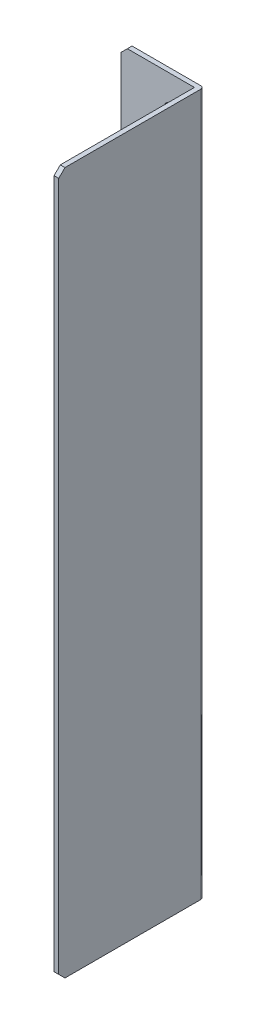
ISO-10303-21;
HEADER;
FILE_DESCRIPTION(('STEP AP214'),'2;1');
FILE_NAME('part.step','',(''),(''),'','','');
FILE_SCHEMA(('AUTOMOTIVE_DESIGN { 1 0 10303 214 1 1 1 1 }'));
ENDSEC;
DATA;
#1=APPLICATION_CONTEXT('core data for automotive mechanical design processes');
#2=APPLICATION_PROTOCOL_DEFINITION('international standard','automotive_design',2000,#1);
#3=PRODUCT_CONTEXT('',#1,'mechanical');
#4=PRODUCT('Part','Part','',(#3));
#5=PRODUCT_RELATED_PRODUCT_CATEGORY('part','',(#4));
#6=PRODUCT_DEFINITION_FORMATION('','',#4);
#7=PRODUCT_DEFINITION_CONTEXT('part definition',#1,'design');
#8=PRODUCT_DEFINITION('design','',#6,#7);
#9=PRODUCT_DEFINITION_SHAPE('','',#8);
#10=(LENGTH_UNIT() NAMED_UNIT(*) SI_UNIT(.MILLI.,.METRE.));
#11=(NAMED_UNIT(*) PLANE_ANGLE_UNIT() SI_UNIT($,.RADIAN.));
#12=(NAMED_UNIT(*) SI_UNIT($,.STERADIAN.) SOLID_ANGLE_UNIT());
#13=UNCERTAINTY_MEASURE_WITH_UNIT(LENGTH_MEASURE(1.E-05),#10,'distance_accuracy_value','');
#14=(GEOMETRIC_REPRESENTATION_CONTEXT(3) GLOBAL_UNCERTAINTY_ASSIGNED_CONTEXT((#13)) GLOBAL_UNIT_ASSIGNED_CONTEXT((#10,
#11,#12)) REPRESENTATION_CONTEXT('',''));
#15=CARTESIAN_POINT('',(0.,0.,0.));
#16=DIRECTION('',(0.,0.,1.));
#17=DIRECTION('',(1.,0.,0.));
#18=AXIS2_PLACEMENT_3D('',#15,#16,#17);
#19=CARTESIAN_POINT('',(-12.9672897196262,188.376168224299,1.5));
#20=DIRECTION('',(1.,0.,0.));
#21=DIRECTION('',(0.,1.,0.));
#22=AXIS2_PLACEMENT_3D('',#19,#20,#21);
#23=PLANE('',#22);
#24=DIRECTION('',(0.,-1.,0.));
#25=VECTOR('',#24,1.);
#26=CARTESIAN_POINT('',(-12.9672897196262,188.376168224299,1.5));
#27=LINE('',#26,#25);
#28=CARTESIAN_POINT('',(-12.9672897196262,186.376168224299,1.5));
#29=VERTEX_POINT('',#28);
#30=CARTESIAN_POINT('',(-12.9672897196262,-26.6238317757009,1.5));
#31=VERTEX_POINT('',#30);
#32=EDGE_CURVE('E161',#29,#31,#27,.T.);
#33=ORIENTED_EDGE('',*,*,#32,.F.);
#34=DIRECTION('',(0.,0.,-1.));
#35=VECTOR('',#34,1.);
#36=CARTESIAN_POINT('',(-12.9672897196262,186.376168224299,1.5));
#37=LINE('',#36,#35);
#38=CARTESIAN_POINT('',(-12.9672897196262,186.376168224299,0.));
#39=VERTEX_POINT('',#38);
#40=EDGE_CURVE('E189',#29,#39,#37,.T.);
#41=ORIENTED_EDGE('',*,*,#40,.T.);
#42=DIRECTION('',(0.,-1.,0.));
#43=VECTOR('',#42,1.);
#44=CARTESIAN_POINT('',(-12.9672897196262,188.376168224299,0.));
#45=LINE('',#44,#43);
#46=CARTESIAN_POINT('',(-12.9672897196262,-26.6238317757009,0.));
#47=VERTEX_POINT('',#46);
#48=EDGE_CURVE('E160',#39,#47,#45,.T.);
#49=ORIENTED_EDGE('',*,*,#48,.T.);
#50=DIRECTION('',(0.,0.,-1.));
#51=VECTOR('',#50,1.);
#52=CARTESIAN_POINT('',(-12.9672897196262,-26.6238317757009,1.5));
#53=LINE('',#52,#51);
#54=EDGE_CURVE('E186',#31,#47,#53,.T.);
#55=ORIENTED_EDGE('',*,*,#54,.F.);
#56=EDGE_LOOP('',(#33,#41,#49,#55));
#57=FACE_BOUND('',#56,.T.);
#58=ADVANCED_FACE('F33',(#57),#23,.F.);
#59=CARTESIAN_POINT('',(-12.9672897196262,-26.6238317757009,1.5));
#60=DIRECTION('',(0.,1.,0.));
#61=DIRECTION('',(0.,0.,1.));
#62=AXIS2_PLACEMENT_3D('',#59,#60,#61);
#63=PLANE('',#62);
#64=DIRECTION('',(1.,0.,0.));
#65=VECTOR('',#64,1.);
#66=CARTESIAN_POINT('',(-12.9672897196262,-26.6238317757009,0.));
#67=LINE('',#66,#65);
#68=CARTESIAN_POINT('',(-7.96728971962616,-26.6238317757009,0.));
#69=VERTEX_POINT('',#68);
#70=EDGE_CURVE('E170',#47,#69,#67,.T.);
#71=ORIENTED_EDGE('',*,*,#70,.T.);
#72=DIRECTION('',(0.,0.,-1.));
#73=VECTOR('',#72,1.);
#74=CARTESIAN_POINT('',(-7.96728971962616,-26.6238317757009,1.5));
#75=LINE('',#74,#73);
#76=CARTESIAN_POINT('',(-7.96728971962616,-26.6238317757009,1.5));
#77=VERTEX_POINT('',#76);
#78=EDGE_CURVE('E183',#77,#69,#75,.T.);
#79=ORIENTED_EDGE('',*,*,#78,.F.);
#80=DIRECTION('',(1.,0.,0.));
#81=VECTOR('',#80,1.);
#82=CARTESIAN_POINT('',(-12.9672897196262,-26.6238317757009,1.5));
#83=LINE('',#82,#81);
#84=EDGE_CURVE('E163',#31,#77,#83,.T.);
#85=ORIENTED_EDGE('',*,*,#84,.F.);
#86=ORIENTED_EDGE('',*,*,#54,.T.);
#87=EDGE_LOOP('',(#71,#79,#85,#86));
#88=FACE_BOUND('',#87,.T.);
#89=ADVANCED_FACE('F248',(#88),#63,.F.);
#90=CARTESIAN_POINT('',(-7.96728971962616,-36.6238317757009,1.5));
#91=DIRECTION('',(1.,0.,0.));
#92=DIRECTION('',(0.,0.,-1.));
#93=AXIS2_PLACEMENT_3D('',#90,#91,#92);
#94=PLANE('',#93);
#95=DIRECTION('',(0.,-1.,0.));
#96=VECTOR('',#95,1.);
#97=CARTESIAN_POINT('',(-7.96728971962616,-36.6238317757009,0.));
#98=LINE('',#97,#96);
#99=CARTESIAN_POINT('',(-7.96728971962616,-36.6238317757009,0.));
#100=VERTEX_POINT('',#99);
#101=EDGE_CURVE('E172',#69,#100,#98,.T.);
#102=ORIENTED_EDGE('',*,*,#101,.T.);
#103=DIRECTION('',(0.,0.,-1.));
#104=VECTOR('',#103,1.);
#105=CARTESIAN_POINT('',(-7.96728971962616,-36.6238317757009,1.5));
#106=LINE('',#105,#104);
#107=CARTESIAN_POINT('',(-7.96728971962616,-36.6238317757009,1.5));
#108=VERTEX_POINT('',#107);
#109=EDGE_CURVE('E181',#108,#100,#106,.T.);
#110=ORIENTED_EDGE('',*,*,#109,.F.);
#111=DIRECTION('',(0.,-1.,0.));
#112=VECTOR('',#111,1.);
#113=CARTESIAN_POINT('',(-7.96728971962616,-36.6238317757009,1.5));
#114=LINE('',#113,#112);
#115=EDGE_CURVE('E142',#77,#108,#114,.T.);
#116=ORIENTED_EDGE('',*,*,#115,.F.);
#117=ORIENTED_EDGE('',*,*,#78,.T.);
#118=EDGE_LOOP('',(#102,#110,#116,#117));
#119=FACE_BOUND('',#118,.T.);
#120=ADVANCED_FACE('F254',(#119),#94,.F.);
#121=CARTESIAN_POINT('',(-7.96728971962616,-36.6238317757009,1.5));
#122=DIRECTION('',(0.,1.,0.));
#123=DIRECTION('',(0.,0.,1.));
#124=AXIS2_PLACEMENT_3D('',#121,#122,#123);
#125=PLANE('',#124);
#126=DIRECTION('',(1.,0.,0.));
#127=VECTOR('',#126,1.);
#128=CARTESIAN_POINT('',(-7.96728971962616,-36.6238317757009,0.));
#129=LINE('',#128,#127);
#130=CARTESIAN_POINT('',(11.0327102803738,-36.6238317757009,0.));
#131=VERTEX_POINT('',#130);
#132=EDGE_CURVE('E174',#100,#131,#129,.T.);
#133=ORIENTED_EDGE('',*,*,#132,.T.);
#134=CARTESIAN_POINT('',(11.0327102803738,-36.6238317757009,1.));
#135=DIRECTION('',(0.,1.,0.));
#136=DIRECTION('',(0.,0.,1.));
#137=AXIS2_PLACEMENT_3D('',#134,#135,#136);
#138=CIRCLE('',#137,1.);
#139=CARTESIAN_POINT('',(12.0327102803738,-36.6238317757009,1.));
#140=VERTEX_POINT('',#139);
#141=EDGE_CURVE('E11',#131,#140,#138,.F.);
#142=ORIENTED_EDGE('',*,*,#141,.T.);
#143=DIRECTION('',(0.,0.,-1.));
#144=VECTOR('',#143,1.);
#145=CARTESIAN_POINT('',(12.0327102803738,-36.6238317757009,1.5));
#146=LINE('',#145,#144);
#147=CARTESIAN_POINT('',(12.0327102803738,-36.6238317757009,44.4999999999999));
#148=VERTEX_POINT('',#147);
#149=EDGE_CURVE('E178',#148,#140,#146,.T.);
#150=ORIENTED_EDGE('',*,*,#149,.F.);
#151=DIRECTION('',(-1.,0.,0.));
#152=VECTOR('',#151,1.);
#153=CARTESIAN_POINT('',(10.5327102803738,-36.6238317757009,44.4999999999999));
#154=LINE('',#153,#152);
#155=CARTESIAN_POINT('',(10.5327102803738,-36.6238317757009,44.4999999999999));
#156=VERTEX_POINT('',#155);
#157=EDGE_CURVE('E128',#148,#156,#154,.T.);
#158=ORIENTED_EDGE('',*,*,#157,.T.);
#159=DIRECTION('',(0.,0.,-1.));
#160=VECTOR('',#159,1.);
#161=CARTESIAN_POINT('',(10.5327102803738,-36.6238317757009,46.5));
#162=LINE('',#161,#160);
#163=CARTESIAN_POINT('',(10.5327102803738,-36.6238317757009,1.5));
#164=VERTEX_POINT('',#163);
#165=EDGE_CURVE('E121',#156,#164,#162,.T.);
#166=ORIENTED_EDGE('',*,*,#165,.T.);
#167=DIRECTION('',(1.,0.,0.));
#168=VECTOR('',#167,1.);
#169=CARTESIAN_POINT('',(-7.96728971962616,-36.6238317757009,1.5));
#170=LINE('',#169,#168);
#171=EDGE_CURVE('E125',#108,#164,#170,.T.);
#172=ORIENTED_EDGE('',*,*,#171,.F.);
#173=ORIENTED_EDGE('',*,*,#109,.T.);
#174=EDGE_LOOP('',(#133,#142,#150,#158,#166,#172,#173));
#175=FACE_BOUND('',#174,.T.);
#176=ADVANCED_FACE('F123',(#175),#125,.F.);
#177=CARTESIAN_POINT('',(12.0327102803738,188.376168224299,1.5));
#178=DIRECTION('',(-1.,0.,0.));
#179=DIRECTION('',(0.,-1.,0.));
#180=AXIS2_PLACEMENT_3D('',#177,#178,#179);
#181=PLANE('',#180);
#182=ORIENTED_EDGE('',*,*,#149,.T.);
#183=DIRECTION('',(0.,1.,0.));
#184=VECTOR('',#183,1.);
#185=CARTESIAN_POINT('',(12.0327102803738,188.376168224299,1.));
#186=LINE('',#185,#184);
#187=CARTESIAN_POINT('',(12.0327102803738,188.376168224299,1.));
#188=VERTEX_POINT('',#187);
#189=EDGE_CURVE('E216',#140,#188,#186,.T.);
#190=ORIENTED_EDGE('',*,*,#189,.T.);
#191=DIRECTION('',(0.,0.,-1.));
#192=VECTOR('',#191,1.);
#193=CARTESIAN_POINT('',(12.0327102803738,188.376168224299,1.5));
#194=LINE('',#193,#192);
#195=CARTESIAN_POINT('',(12.0327102803738,188.376168224299,44.5));
#196=VERTEX_POINT('',#195);
#197=EDGE_CURVE('E168',#196,#188,#194,.T.);
#198=ORIENTED_EDGE('',*,*,#197,.F.);
#199=DIRECTION('',(0.,-0.707106781186552,0.707106781186543));
#200=VECTOR('',#199,1.);
#201=CARTESIAN_POINT('',(12.0327102803738,186.376168224299,46.5));
#202=LINE('',#201,#200);
#203=CARTESIAN_POINT('',(12.0327102803738,186.376168224299,46.5));
#204=VERTEX_POINT('',#203);
#205=EDGE_CURVE('E213',#196,#204,#202,.T.);
#206=ORIENTED_EDGE('',*,*,#205,.T.);
#207=DIRECTION('',(0.,1.,0.));
#208=VECTOR('',#207,1.);
#209=CARTESIAN_POINT('',(12.0327102803738,-36.6238317757009,46.5));
#210=LINE('',#209,#208);
#211=CARTESIAN_POINT('',(12.0327102803738,-34.6238317757009,46.5));
#212=VERTEX_POINT('',#211);
#213=EDGE_CURVE('E149',#212,#204,#210,.T.);
#214=ORIENTED_EDGE('',*,*,#213,.F.);
#215=DIRECTION('',(0.,-0.707106781186548,-0.707106781186548));
#216=VECTOR('',#215,1.);
#217=CARTESIAN_POINT('',(12.0327102803738,-34.6238317757009,46.5));
#218=LINE('',#217,#216);
#219=EDGE_CURVE('E211',#212,#148,#218,.T.);
#220=ORIENTED_EDGE('',*,*,#219,.T.);
#221=EDGE_LOOP('',(#182,#190,#198,#206,#214,#220));
#222=FACE_BOUND('',#221,.T.);
#223=ADVANCED_FACE('F222',(#222),#181,.F.);
#224=CARTESIAN_POINT('',(-12.9672897196262,188.376168224299,1.5));
#225=DIRECTION('',(0.,-1.,0.));
#226=DIRECTION('',(0.,0.,-1.));
#227=AXIS2_PLACEMENT_3D('',#224,#225,#226);
#228=PLANE('',#227);
#229=ORIENTED_EDGE('',*,*,#197,.T.);
#230=CARTESIAN_POINT('',(11.0327102803738,188.376168224299,1.));
#231=DIRECTION('',(0.,-1.,0.));
#232=DIRECTION('',(0.,0.,-1.));
#233=AXIS2_PLACEMENT_3D('',#230,#231,#232);
#234=CIRCLE('',#233,1.);
#235=CARTESIAN_POINT('',(11.0327102803738,188.376168224299,0.));
#236=VERTEX_POINT('',#235);
#237=EDGE_CURVE('E55',#188,#236,#234,.F.);
#238=ORIENTED_EDGE('',*,*,#237,.T.);
#239=DIRECTION('',(-1.,0.,0.));
#240=VECTOR('',#239,1.);
#241=CARTESIAN_POINT('',(-12.9672897196262,188.376168224299,0.));
#242=LINE('',#241,#240);
#243=CARTESIAN_POINT('',(-10.9672897196262,188.376168224299,0.));
#244=VERTEX_POINT('',#243);
#245=EDGE_CURVE('E164',#236,#244,#242,.T.);
#246=ORIENTED_EDGE('',*,*,#245,.T.);
#247=DIRECTION('',(0.,0.,1.));
#248=VECTOR('',#247,1.);
#249=CARTESIAN_POINT('',(-10.9672897196262,188.376168224299,1.5));
#250=LINE('',#249,#248);
#251=CARTESIAN_POINT('',(-10.9672897196262,188.376168224299,1.5));
#252=VERTEX_POINT('',#251);
#253=EDGE_CURVE('E197',#244,#252,#250,.T.);
#254=ORIENTED_EDGE('',*,*,#253,.T.);
#255=DIRECTION('',(-1.,0.,0.));
#256=VECTOR('',#255,1.);
#257=CARTESIAN_POINT('',(-12.9672897196262,188.376168224299,1.5));
#258=LINE('',#257,#256);
#259=CARTESIAN_POINT('',(10.5327102803738,188.376168224299,1.5));
#260=VERTEX_POINT('',#259);
#261=EDGE_CURVE('E144',#260,#252,#258,.T.);
#262=ORIENTED_EDGE('',*,*,#261,.F.);
#263=DIRECTION('',(0.,0.,-1.));
#264=VECTOR('',#263,1.);
#265=CARTESIAN_POINT('',(10.5327102803738,188.376168224299,46.5));
#266=LINE('',#265,#264);
#267=CARTESIAN_POINT('',(10.5327102803738,188.376168224299,44.5));
#268=VERTEX_POINT('',#267);
#269=EDGE_CURVE('E132',#268,#260,#266,.T.);
#270=ORIENTED_EDGE('',*,*,#269,.F.);
#271=DIRECTION('',(1.,0.,0.));
#272=VECTOR('',#271,1.);
#273=CARTESIAN_POINT('',(12.0327102803738,188.376168224299,44.5));
#274=LINE('',#273,#272);
#275=EDGE_CURVE('E195',#268,#196,#274,.T.);
#276=ORIENTED_EDGE('',*,*,#275,.T.);
#277=EDGE_LOOP('',(#229,#238,#246,#254,#262,#270,#276));
#278=FACE_BOUND('',#277,.T.);
#279=ADVANCED_FACE('F226',(#278),#228,.F.);
#280=CARTESIAN_POINT('',(0.,0.,1.5));
#281=DIRECTION('',(0.,0.,1.));
#282=DIRECTION('',(1.,0.,0.));
#283=AXIS2_PLACEMENT_3D('',#280,#281,#282);
#284=PLANE('',#283);
#285=CARTESIAN_POINT('',(3.03271028037384,-29.0146314642925,1.5));
#286=DIRECTION('',(0.,0.,1.));
#287=DIRECTION('',(1.,0.,0.));
#288=AXIS2_PLACEMENT_3D('',#285,#286,#287);
#289=CIRCLE('',#288,2.25);
#290=CARTESIAN_POINT('',(5.28271028037384,-29.0146314642925,1.5));
#291=VERTEX_POINT('',#290);
#292=EDGE_CURVE('E403',#291,#291,#289,.T.);
#293=ORIENTED_EDGE('',*,*,#292,.F.);
#294=EDGE_LOOP('',(#293));
#295=FACE_BOUND('',#294,.T.);
#296=CARTESIAN_POINT('',(3.03271028037384,177.946548893374,1.5));
#297=DIRECTION('',(0.,0.,1.));
#298=DIRECTION('',(1.,0.,0.));
#299=AXIS2_PLACEMENT_3D('',#296,#297,#298);
#300=CIRCLE('',#299,2.25);
#301=CARTESIAN_POINT('',(5.28271028037384,177.946548893374,1.5));
#302=VERTEX_POINT('',#301);
#303=EDGE_CURVE('E155',#302,#302,#300,.T.);
#304=ORIENTED_EDGE('',*,*,#303,.F.);
#305=EDGE_LOOP('',(#304));
#306=FACE_BOUND('',#305,.T.);
#307=ORIENTED_EDGE('',*,*,#261,.T.);
#308=DIRECTION('',(0.707106781186543,0.707106781186552,0.));
#309=VECTOR('',#308,1.);
#310=CARTESIAN_POINT('',(-99.6717289719627,99.6717289719613,1.5));
#311=LINE('',#310,#309);
#312=EDGE_CURVE('E199',#252,#29,#311,.F.);
#313=ORIENTED_EDGE('',*,*,#312,.T.);
#314=ORIENTED_EDGE('',*,*,#32,.T.);
#315=ORIENTED_EDGE('',*,*,#84,.T.);
#316=ORIENTED_EDGE('',*,*,#115,.T.);
#317=ORIENTED_EDGE('',*,*,#171,.T.);
#318=DIRECTION('',(0.,-1.,0.));
#319=VECTOR('',#318,1.);
#320=CARTESIAN_POINT('',(10.5327102803738,-36.6238317757009,1.5));
#321=LINE('',#320,#319);
#322=EDGE_CURVE('E139',#260,#164,#321,.T.);
#323=ORIENTED_EDGE('',*,*,#322,.F.);
#324=EDGE_LOOP('',(#307,#313,#314,#315,#316,#317,#323));
#325=FACE_BOUND('',#324,.T.);
#326=ADVANCED_FACE('F138',(#295,#306,#325),#284,.T.);
#327=CARTESIAN_POINT('',(0.,0.,0.));
#328=DIRECTION('',(0.,0.,1.));
#329=DIRECTION('',(1.,0.,0.));
#330=AXIS2_PLACEMENT_3D('',#327,#328,#329);
#331=PLANE('',#330);
#332=CARTESIAN_POINT('',(3.03271028037384,-29.0146314642925,0.));
#333=DIRECTION('',(0.,0.,1.));
#334=DIRECTION('',(1.,0.,0.));
#335=AXIS2_PLACEMENT_3D('',#332,#333,#334);
#336=CIRCLE('',#335,2.25);
#337=CARTESIAN_POINT('',(5.28271028037384,-29.0146314642925,0.));
#338=VERTEX_POINT('',#337);
#339=EDGE_CURVE('E400',#338,#338,#336,.T.);
#340=ORIENTED_EDGE('',*,*,#339,.T.);
#341=EDGE_LOOP('',(#340));
#342=FACE_BOUND('',#341,.T.);
#343=CARTESIAN_POINT('',(3.03271028037384,177.946548893374,0.));
#344=DIRECTION('',(0.,0.,1.));
#345=DIRECTION('',(1.,0.,0.));
#346=AXIS2_PLACEMENT_3D('',#343,#344,#345);
#347=CIRCLE('',#346,2.25);
#348=CARTESIAN_POINT('',(5.28271028037384,177.946548893374,0.));
#349=VERTEX_POINT('',#348);
#350=EDGE_CURVE('E150',#349,#349,#347,.T.);
#351=ORIENTED_EDGE('',*,*,#350,.T.);
#352=EDGE_LOOP('',(#351));
#353=FACE_BOUND('',#352,.T.);
#354=ORIENTED_EDGE('',*,*,#245,.F.);
#355=DIRECTION('',(0.,1.,0.));
#356=VECTOR('',#355,1.);
#357=CARTESIAN_POINT('',(11.0327102803738,0.,0.));
#358=LINE('',#357,#356);
#359=EDGE_CURVE('E41',#236,#131,#358,.F.);
#360=ORIENTED_EDGE('',*,*,#359,.T.);
#361=ORIENTED_EDGE('',*,*,#132,.F.);
#362=ORIENTED_EDGE('',*,*,#101,.F.);
#363=ORIENTED_EDGE('',*,*,#70,.F.);
#364=ORIENTED_EDGE('',*,*,#48,.F.);
#365=DIRECTION('',(-0.707106781186543,-0.707106781186552,0.));
#366=VECTOR('',#365,1.);
#367=CARTESIAN_POINT('',(-12.9672897196262,186.376168224299,0.));
#368=LINE('',#367,#366);
#369=EDGE_CURVE('E192',#39,#244,#368,.F.);
#370=ORIENTED_EDGE('',*,*,#369,.T.);
#371=EDGE_LOOP('',(#354,#360,#361,#362,#363,#364,#370));
#372=FACE_BOUND('',#371,.T.);
#373=ADVANCED_FACE('F318',(#342,#353,#372),#331,.F.);
#374=CARTESIAN_POINT('',(10.5327102803738,-36.6238317757009,46.5));
#375=DIRECTION('',(1.,0.,0.));
#376=DIRECTION('',(0.,0.,-1.));
#377=AXIS2_PLACEMENT_3D('',#374,#375,#376);
#378=PLANE('',#377);
#379=DIRECTION('',(0.,-1.,0.));
#380=VECTOR('',#379,1.);
#381=CARTESIAN_POINT('',(10.5327102803738,-36.6238317757009,46.5));
#382=LINE('',#381,#380);
#383=CARTESIAN_POINT('',(10.5327102803738,186.376168224299,46.5));
#384=VERTEX_POINT('',#383);
#385=CARTESIAN_POINT('',(10.5327102803738,-34.6238317757009,46.5));
#386=VERTEX_POINT('',#385);
#387=EDGE_CURVE('E133',#384,#386,#382,.T.);
#388=ORIENTED_EDGE('',*,*,#387,.F.);
#389=DIRECTION('',(0.,0.707106781186553,-0.707106781186543));
#390=VECTOR('',#389,1.);
#391=CARTESIAN_POINT('',(10.5327102803738,186.376168224299,46.5));
#392=LINE('',#391,#390);
#393=EDGE_CURVE('E209',#384,#268,#392,.T.);
#394=ORIENTED_EDGE('',*,*,#393,.T.);
#395=ORIENTED_EDGE('',*,*,#269,.T.);
#396=ORIENTED_EDGE('',*,*,#322,.T.);
#397=ORIENTED_EDGE('',*,*,#165,.F.);
#398=DIRECTION('',(0.,0.707106781186548,0.707106781186548));
#399=VECTOR('',#398,1.);
#400=CARTESIAN_POINT('',(10.5327102803738,-34.6238317757009,46.5));
#401=LINE('',#400,#399);
#402=EDGE_CURVE('E207',#156,#386,#401,.T.);
#403=ORIENTED_EDGE('',*,*,#402,.T.);
#404=EDGE_LOOP('',(#388,#394,#395,#396,#397,#403));
#405=FACE_BOUND('',#404,.T.);
#406=ADVANCED_FACE('F147',(#405),#378,.F.);
#407=CARTESIAN_POINT('',(0.,0.,46.5));
#408=DIRECTION('',(0.,0.,1.));
#409=DIRECTION('',(1.,0.,0.));
#410=AXIS2_PLACEMENT_3D('',#407,#408,#409);
#411=PLANE('',#410);
#412=ORIENTED_EDGE('',*,*,#213,.T.);
#413=DIRECTION('',(-1.,0.,0.));
#414=VECTOR('',#413,1.);
#415=CARTESIAN_POINT('',(10.5327102803738,186.376168224299,46.5));
#416=LINE('',#415,#414);
#417=EDGE_CURVE('E204',#204,#384,#416,.T.);
#418=ORIENTED_EDGE('',*,*,#417,.T.);
#419=ORIENTED_EDGE('',*,*,#387,.T.);
#420=DIRECTION('',(1.,0.,0.));
#421=VECTOR('',#420,1.);
#422=CARTESIAN_POINT('',(12.0327102803738,-34.6238317757009,46.5));
#423=LINE('',#422,#421);
#424=EDGE_CURVE('E201',#386,#212,#423,.T.);
#425=ORIENTED_EDGE('',*,*,#424,.T.);
#426=EDGE_LOOP('',(#412,#418,#419,#425));
#427=FACE_BOUND('',#426,.T.);
#428=ADVANCED_FACE('F233',(#427),#411,.T.);
#429=CARTESIAN_POINT('',(-12.9672897196262,186.376168224299,1.5));
#430=DIRECTION('',(0.707106781186552,-0.707106781186542,0.));
#431=DIRECTION('',(0.,0.,-1.));
#432=AXIS2_PLACEMENT_3D('',#429,#430,#431);
#433=PLANE('',#432);
#434=ORIENTED_EDGE('',*,*,#312,.F.);
#435=ORIENTED_EDGE('',*,*,#253,.F.);
#436=ORIENTED_EDGE('',*,*,#369,.F.);
#437=ORIENTED_EDGE('',*,*,#40,.F.);
#438=EDGE_LOOP('',(#434,#435,#436,#437));
#439=FACE_BOUND('',#438,.T.);
#440=ADVANCED_FACE('F260',(#439),#433,.F.);
#441=CARTESIAN_POINT('',(0.,186.376168224299,46.5));
#442=DIRECTION('',(0.,0.707106781186542,0.707106781186552));
#443=DIRECTION('',(1.,0.,0.));
#444=AXIS2_PLACEMENT_3D('',#441,#442,#443);
#445=PLANE('',#444);
#446=ORIENTED_EDGE('',*,*,#205,.F.);
#447=ORIENTED_EDGE('',*,*,#275,.F.);
#448=ORIENTED_EDGE('',*,*,#393,.F.);
#449=ORIENTED_EDGE('',*,*,#417,.F.);
#450=EDGE_LOOP('',(#446,#447,#448,#449));
#451=FACE_BOUND('',#450,.T.);
#452=ADVANCED_FACE('F229',(#451),#445,.T.);
#453=CARTESIAN_POINT('',(0.,-34.6238317757009,46.5));
#454=DIRECTION('',(0.,-0.707106781186548,0.707106781186548));
#455=DIRECTION('',(-1.,0.,0.));
#456=AXIS2_PLACEMENT_3D('',#453,#454,#455);
#457=PLANE('',#456);
#458=ORIENTED_EDGE('',*,*,#402,.F.);
#459=ORIENTED_EDGE('',*,*,#157,.F.);
#460=ORIENTED_EDGE('',*,*,#219,.F.);
#461=ORIENTED_EDGE('',*,*,#424,.F.);
#462=EDGE_LOOP('',(#458,#459,#460,#461));
#463=FACE_BOUND('',#462,.T.);
#464=ADVANCED_FACE('F237',(#463),#457,.T.);
#465=CARTESIAN_POINT('',(11.0327102803738,188.376168224299,1.));
#466=DIRECTION('',(0.,1.,0.));
#467=DIRECTION('',(-1.,0.,0.));
#468=AXIS2_PLACEMENT_3D('',#465,#466,#467);
#469=CYLINDRICAL_SURFACE('',#468,1.);
#470=ORIENTED_EDGE('',*,*,#141,.F.);
#471=ORIENTED_EDGE('',*,*,#359,.F.);
#472=ORIENTED_EDGE('',*,*,#237,.F.);
#473=ORIENTED_EDGE('',*,*,#189,.F.);
#474=EDGE_LOOP('',(#470,#471,#472,#473));
#475=FACE_BOUND('',#474,.T.);
#476=ADVANCED_FACE('F35',(#475),#469,.T.);
#477=CARTESIAN_POINT('',(3.03271028037384,177.946548893374,0.));
#478=DIRECTION('',(0.,0.,1.));
#479=DIRECTION('',(1.,0.,0.));
#480=AXIS2_PLACEMENT_3D('',#477,#478,#479);
#481=CYLINDRICAL_SURFACE('',#480,2.25);
#482=ORIENTED_EDGE('',*,*,#350,.F.);
#483=EDGE_LOOP('',(#482));
#484=FACE_BOUND('',#483,.T.);
#485=ORIENTED_EDGE('',*,*,#303,.T.);
#486=EDGE_LOOP('',(#485));
#487=FACE_BOUND('',#486,.T.);
#488=ADVANCED_FACE('F239',(#484,#487),#481,.F.);
#489=CARTESIAN_POINT('',(3.03271028037384,-29.0146314642925,0.));
#490=DIRECTION('',(0.,0.,1.));
#491=DIRECTION('',(1.,0.,0.));
#492=AXIS2_PLACEMENT_3D('',#489,#490,#491);
#493=CYLINDRICAL_SURFACE('',#492,2.25);
#494=ORIENTED_EDGE('',*,*,#339,.F.);
#495=EDGE_LOOP('',(#494));
#496=FACE_BOUND('',#495,.T.);
#497=ORIENTED_EDGE('',*,*,#292,.T.);
#498=EDGE_LOOP('',(#497));
#499=FACE_BOUND('',#498,.T.);
#500=ADVANCED_FACE('F244',(#496,#499),#493,.F.);
#501=CLOSED_SHELL('',(#58,#89,#120,#176,#223,#279,#326,#373,#406,#428,#440,#452,#464,#476,#488,#500));
#502=MANIFOLD_SOLID_BREP('B2',#501);
#503=ADVANCED_BREP_SHAPE_REPRESENTATION('',(#18,#502),#14);
#504=SHAPE_DEFINITION_REPRESENTATION(#9,#503);
ENDSEC;
END-ISO-10303-21;
